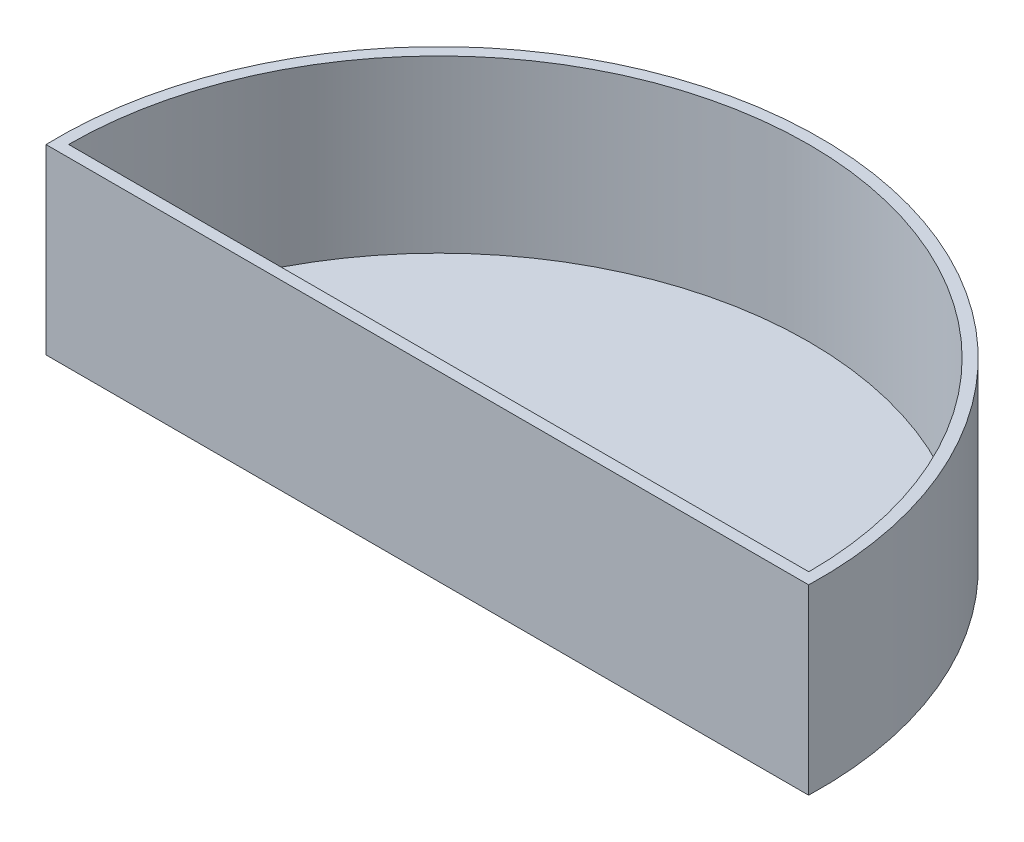
ISO-10303-21;
HEADER;
FILE_DESCRIPTION(('STEP AP214'),'2;1');
FILE_NAME('part.step','',(''),(''),'','','');
FILE_SCHEMA(('AUTOMOTIVE_DESIGN { 1 0 10303 214 1 1 1 1 }'));
ENDSEC;
DATA;
#1=APPLICATION_CONTEXT('core data for automotive mechanical design processes');
#2=APPLICATION_PROTOCOL_DEFINITION('international standard','automotive_design',2000,#1);
#3=PRODUCT_CONTEXT('',#1,'mechanical');
#4=PRODUCT('Part','Part','',(#3));
#5=PRODUCT_RELATED_PRODUCT_CATEGORY('part','',(#4));
#6=PRODUCT_DEFINITION_FORMATION('','',#4);
#7=PRODUCT_DEFINITION_CONTEXT('part definition',#1,'design');
#8=PRODUCT_DEFINITION('design','',#6,#7);
#9=PRODUCT_DEFINITION_SHAPE('','',#8);
#10=(LENGTH_UNIT() NAMED_UNIT(*) SI_UNIT(.MILLI.,.METRE.));
#11=(NAMED_UNIT(*) PLANE_ANGLE_UNIT() SI_UNIT($,.RADIAN.));
#12=(NAMED_UNIT(*) SI_UNIT($,.STERADIAN.) SOLID_ANGLE_UNIT());
#13=UNCERTAINTY_MEASURE_WITH_UNIT(LENGTH_MEASURE(1.E-05),#10,'distance_accuracy_value','');
#14=(GEOMETRIC_REPRESENTATION_CONTEXT(3) GLOBAL_UNCERTAINTY_ASSIGNED_CONTEXT((#13)) GLOBAL_UNIT_ASSIGNED_CONTEXT((#10,
#11,#12)) REPRESENTATION_CONTEXT('',''));
#15=CARTESIAN_POINT('',(0.,0.,0.));
#16=DIRECTION('',(0.,0.,1.));
#17=DIRECTION('',(1.,0.,0.));
#18=AXIS2_PLACEMENT_3D('',#15,#16,#17);
#19=CARTESIAN_POINT('',(0.,6.,0.));
#20=DIRECTION('',(0.,1.,0.));
#21=DIRECTION('',(0.,0.,1.));
#22=AXIS2_PLACEMENT_3D('',#19,#20,#21);
#23=PLANE('',#22);
#24=CARTESIAN_POINT('',(0.,6.,0.));
#25=DIRECTION('',(0.,1.,0.));
#26=DIRECTION('',(0.,0.,1.));
#27=AXIS2_PLACEMENT_3D('',#24,#25,#26);
#28=CIRCLE('',#27,13.4);
#29=CARTESIAN_POINT('',(13.3940285202026,6.,0.4));
#30=VERTEX_POINT('',#29);
#31=CARTESIAN_POINT('',(-13.3940285202026,6.,0.399999999999999));
#32=VERTEX_POINT('',#31);
#33=EDGE_CURVE('E84',#30,#32,#28,.T.);
#34=ORIENTED_EDGE('',*,*,#33,.T.);
#35=DIRECTION('',(1.,0.,0.));
#36=VECTOR('',#35,1.);
#37=CARTESIAN_POINT('',(-13.3940285202026,6.,0.399999999999999));
#38=LINE('',#37,#36);
#39=EDGE_CURVE('E62',#32,#30,#38,.T.);
#40=ORIENTED_EDGE('',*,*,#39,.T.);
#41=EDGE_LOOP('',(#34,#40));
#42=FACE_BOUND('',#41,.T.);
#43=DIRECTION('',(1.,0.,0.));
#44=VECTOR('',#43,1.);
#45=CARTESIAN_POINT('',(-13.,6.,0.));
#46=LINE('',#45,#44);
#47=CARTESIAN_POINT('',(-13.,6.,0.));
#48=VERTEX_POINT('',#47);
#49=CARTESIAN_POINT('',(13.,6.,0.));
#50=VERTEX_POINT('',#49);
#51=EDGE_CURVE('E101',#48,#50,#46,.T.);
#52=ORIENTED_EDGE('',*,*,#51,.F.);
#53=CARTESIAN_POINT('',(0.,6.,0.));
#54=DIRECTION('',(0.,1.,0.));
#55=DIRECTION('',(0.,0.,1.));
#56=AXIS2_PLACEMENT_3D('',#53,#54,#55);
#57=CIRCLE('',#56,13.);
#58=EDGE_CURVE('E98',#50,#48,#57,.T.);
#59=ORIENTED_EDGE('',*,*,#58,.F.);
#60=EDGE_LOOP('',(#52,#59));
#61=FACE_BOUND('',#60,.T.);
#62=ADVANCED_FACE('F39',(#42,#61),#23,.T.);
#63=CARTESIAN_POINT('',(0.,6.,0.));
#64=DIRECTION('',(0.,-1.,0.));
#65=DIRECTION('',(0.,0.,-1.));
#66=AXIS2_PLACEMENT_3D('',#63,#64,#65);
#67=CYLINDRICAL_SURFACE('',#66,13.4);
#68=DIRECTION('',(0.,-1.,0.));
#69=VECTOR('',#68,1.);
#70=CARTESIAN_POINT('',(13.3940285202026,6.,0.4));
#71=LINE('',#70,#69);
#72=CARTESIAN_POINT('',(13.3940285202026,-0.4,0.4));
#73=VERTEX_POINT('',#72);
#74=EDGE_CURVE('E48',#30,#73,#71,.T.);
#75=ORIENTED_EDGE('',*,*,#74,.T.);
#76=CARTESIAN_POINT('',(0.,-0.4,0.));
#77=DIRECTION('',(0.,-1.,0.));
#78=DIRECTION('',(0.,0.,-1.));
#79=AXIS2_PLACEMENT_3D('',#76,#77,#78);
#80=CIRCLE('',#79,13.4);
#81=CARTESIAN_POINT('',(-13.3940285202026,-0.4,0.399999999999999));
#82=VERTEX_POINT('',#81);
#83=EDGE_CURVE('E83',#82,#73,#80,.T.);
#84=ORIENTED_EDGE('',*,*,#83,.F.);
#85=DIRECTION('',(0.,-1.,0.));
#86=VECTOR('',#85,1.);
#87=CARTESIAN_POINT('',(-13.3940285202026,6.,0.399999999999999));
#88=LINE('',#87,#86);
#89=EDGE_CURVE('E11',#32,#82,#88,.T.);
#90=ORIENTED_EDGE('',*,*,#89,.F.);
#91=ORIENTED_EDGE('',*,*,#33,.F.);
#92=EDGE_LOOP('',(#75,#84,#90,#91));
#93=FACE_BOUND('',#92,.T.);
#94=ADVANCED_FACE('F41',(#93),#67,.T.);
#95=CARTESIAN_POINT('',(-13.3940285202026,6.,0.399999999999999));
#96=DIRECTION('',(0.,0.,-1.));
#97=DIRECTION('',(-1.,0.,0.));
#98=AXIS2_PLACEMENT_3D('',#95,#96,#97);
#99=PLANE('',#98);
#100=ORIENTED_EDGE('',*,*,#89,.T.);
#101=DIRECTION('',(-1.,0.,0.));
#102=VECTOR('',#101,1.);
#103=CARTESIAN_POINT('',(-13.3940285202026,-0.4,0.399999999999999));
#104=LINE('',#103,#102);
#105=EDGE_CURVE('E88',#73,#82,#104,.T.);
#106=ORIENTED_EDGE('',*,*,#105,.F.);
#107=ORIENTED_EDGE('',*,*,#74,.F.);
#108=ORIENTED_EDGE('',*,*,#39,.F.);
#109=EDGE_LOOP('',(#100,#106,#107,#108));
#110=FACE_BOUND('',#109,.T.);
#111=ADVANCED_FACE('F89',(#110),#99,.F.);
#112=CARTESIAN_POINT('',(0.,6.,0.));
#113=DIRECTION('',(0.,-1.,0.));
#114=DIRECTION('',(0.,0.,-1.));
#115=AXIS2_PLACEMENT_3D('',#112,#113,#114);
#116=CYLINDRICAL_SURFACE('',#115,13.);
#117=CARTESIAN_POINT('',(0.,0.,0.));
#118=DIRECTION('',(0.,1.,0.));
#119=DIRECTION('',(0.,0.,1.));
#120=AXIS2_PLACEMENT_3D('',#117,#118,#119);
#121=CIRCLE('',#120,13.);
#122=CARTESIAN_POINT('',(13.,0.,0.));
#123=VERTEX_POINT('',#122);
#124=CARTESIAN_POINT('',(-13.,0.,0.));
#125=VERTEX_POINT('',#124);
#126=EDGE_CURVE('E92',#123,#125,#121,.T.);
#127=ORIENTED_EDGE('',*,*,#126,.F.);
#128=DIRECTION('',(0.,-1.,0.));
#129=VECTOR('',#128,1.);
#130=CARTESIAN_POINT('',(13.,6.,0.));
#131=LINE('',#130,#129);
#132=EDGE_CURVE('E105',#50,#123,#131,.T.);
#133=ORIENTED_EDGE('',*,*,#132,.F.);
#134=ORIENTED_EDGE('',*,*,#58,.T.);
#135=DIRECTION('',(0.,-1.,0.));
#136=VECTOR('',#135,1.);
#137=CARTESIAN_POINT('',(-13.,6.,0.));
#138=LINE('',#137,#136);
#139=EDGE_CURVE('E55',#48,#125,#138,.T.);
#140=ORIENTED_EDGE('',*,*,#139,.T.);
#141=EDGE_LOOP('',(#127,#133,#134,#140));
#142=FACE_BOUND('',#141,.T.);
#143=ADVANCED_FACE('F128',(#142),#116,.F.);
#144=CARTESIAN_POINT('',(-13.,6.,0.));
#145=DIRECTION('',(0.,0.,-1.));
#146=DIRECTION('',(-1.,0.,0.));
#147=AXIS2_PLACEMENT_3D('',#144,#145,#146);
#148=PLANE('',#147);
#149=DIRECTION('',(1.,0.,0.));
#150=VECTOR('',#149,1.);
#151=CARTESIAN_POINT('',(-13.,0.,0.));
#152=LINE('',#151,#150);
#153=EDGE_CURVE('E102',#125,#123,#152,.T.);
#154=ORIENTED_EDGE('',*,*,#153,.F.);
#155=ORIENTED_EDGE('',*,*,#139,.F.);
#156=ORIENTED_EDGE('',*,*,#51,.T.);
#157=ORIENTED_EDGE('',*,*,#132,.T.);
#158=EDGE_LOOP('',(#154,#155,#156,#157));
#159=FACE_BOUND('',#158,.T.);
#160=ADVANCED_FACE('F125',(#159),#148,.T.);
#161=CARTESIAN_POINT('',(0.,0.,0.));
#162=DIRECTION('',(0.,-1.,0.));
#163=DIRECTION('',(0.,0.,-1.));
#164=AXIS2_PLACEMENT_3D('',#161,#162,#163);
#165=PLANE('',#164);
#166=ORIENTED_EDGE('',*,*,#153,.T.);
#167=ORIENTED_EDGE('',*,*,#126,.T.);
#168=EDGE_LOOP('',(#166,#167));
#169=FACE_BOUND('',#168,.T.);
#170=ADVANCED_FACE('F130',(#169),#165,.F.);
#171=CARTESIAN_POINT('',(0.,-0.4,0.));
#172=DIRECTION('',(0.,-1.,0.));
#173=DIRECTION('',(0.,0.,-1.));
#174=AXIS2_PLACEMENT_3D('',#171,#172,#173);
#175=PLANE('',#174);
#176=ORIENTED_EDGE('',*,*,#83,.T.);
#177=ORIENTED_EDGE('',*,*,#105,.T.);
#178=EDGE_LOOP('',(#176,#177));
#179=FACE_BOUND('',#178,.T.);
#180=ADVANCED_FACE('F94',(#179),#175,.T.);
#181=CLOSED_SHELL('',(#62,#94,#111,#143,#160,#170,#180));
#182=MANIFOLD_SOLID_BREP('B2',#181);
#183=ADVANCED_BREP_SHAPE_REPRESENTATION('',(#18,#182),#14);
#184=SHAPE_DEFINITION_REPRESENTATION(#9,#183);
ENDSEC;
END-ISO-10303-21;
